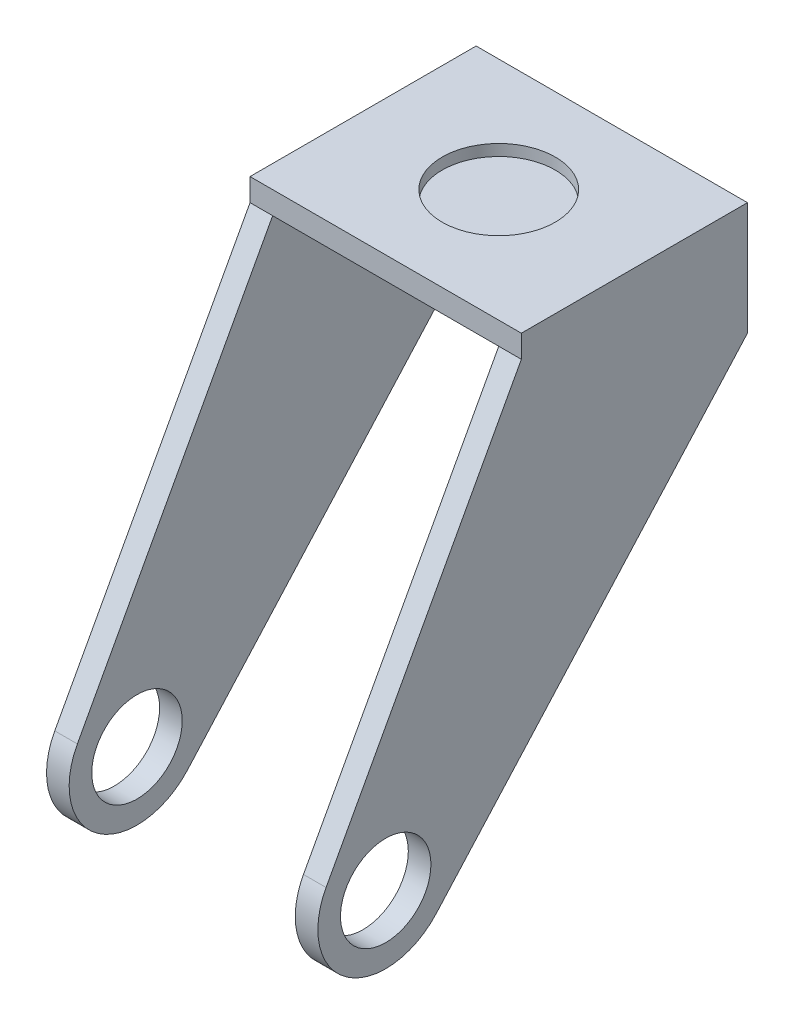
ISO-10303-21;
HEADER;
FILE_DESCRIPTION(('STEP AP214'),'2;1');
FILE_NAME('part.step','',(''),(''),'','','');
FILE_SCHEMA(('AUTOMOTIVE_DESIGN { 1 0 10303 214 1 1 1 1 }'));
ENDSEC;
DATA;
#1=APPLICATION_CONTEXT('core data for automotive mechanical design processes');
#2=APPLICATION_PROTOCOL_DEFINITION('international standard','automotive_design',2000,#1);
#3=PRODUCT_CONTEXT('',#1,'mechanical');
#4=PRODUCT('Part','Part','',(#3));
#5=PRODUCT_RELATED_PRODUCT_CATEGORY('part','',(#4));
#6=PRODUCT_DEFINITION_FORMATION('','',#4);
#7=PRODUCT_DEFINITION_CONTEXT('part definition',#1,'design');
#8=PRODUCT_DEFINITION('design','',#6,#7);
#9=PRODUCT_DEFINITION_SHAPE('','',#8);
#10=(LENGTH_UNIT() NAMED_UNIT(*) SI_UNIT(.MILLI.,.METRE.));
#11=(NAMED_UNIT(*) PLANE_ANGLE_UNIT() SI_UNIT($,.RADIAN.));
#12=(NAMED_UNIT(*) SI_UNIT($,.STERADIAN.) SOLID_ANGLE_UNIT());
#13=UNCERTAINTY_MEASURE_WITH_UNIT(LENGTH_MEASURE(1.E-05),#10,'distance_accuracy_value','');
#14=(GEOMETRIC_REPRESENTATION_CONTEXT(3) GLOBAL_UNCERTAINTY_ASSIGNED_CONTEXT((#13)) GLOBAL_UNIT_ASSIGNED_CONTEXT((#10,
#11,#12)) REPRESENTATION_CONTEXT('',''));
#15=CARTESIAN_POINT('',(0.,0.,0.));
#16=DIRECTION('',(0.,0.,1.));
#17=DIRECTION('',(1.,0.,0.));
#18=AXIS2_PLACEMENT_3D('',#15,#16,#17);
#19=CARTESIAN_POINT('',(5.,-86.722822296021,29.9981498854089));
#20=DIRECTION('',(1.,0.,0.));
#21=DIRECTION('',(0.,0.,-1.));
#22=AXIS2_PLACEMENT_3D('',#19,#20,#21);
#23=PLANE('',#22);
#24=DIRECTION('',(0.,-0.878900379190603,0.477005370471459));
#25=VECTOR('',#24,1.);
#26=CARTESIAN_POINT('',(5.,0.,0.));
#27=LINE('',#26,#25);
#28=CARTESIAN_POINT('',(5.,0.,0.));
#29=VERTEX_POINT('',#28);
#30=CARTESIAN_POINT('',(5.,-79.5668513281253,43.1832961887812));
#31=VERTEX_POINT('',#30);
#32=EDGE_CURVE('E230',#29,#31,#27,.T.);
#33=ORIENTED_EDGE('',*,*,#32,.T.);
#34=CARTESIAN_POINT('',(5.,-86.722822296021,29.9981498854089));
#35=DIRECTION('',(1.,0.,0.));
#36=DIRECTION('',(0.,0.,-1.));
#37=AXIS2_PLACEMENT_3D('',#34,#35,#36);
#38=CIRCLE('',#37,15.0018666683416);
#39=CARTESIAN_POINT('',(5.,-96.7356478948339,18.8267879692208));
#40=VERTEX_POINT('',#39);
#41=EDGE_CURVE('E83',#31,#40,#38,.T.);
#42=ORIENTED_EDGE('',*,*,#41,.T.);
#43=DIRECTION('',(0.,0.744428093663503,-0.667702638428607));
#44=VECTOR('',#43,1.);
#45=CARTESIAN_POINT('',(5.,-96.7356478948339,18.8267879692208));
#46=LINE('',#45,#44);
#47=CARTESIAN_POINT('',(5.,-20.,-50.));
#48=VERTEX_POINT('',#47);
#49=EDGE_CURVE('E236',#40,#48,#46,.T.);
#50=ORIENTED_EDGE('',*,*,#49,.T.);
#51=DIRECTION('',(0.,1.,0.));
#52=VECTOR('',#51,1.);
#53=CARTESIAN_POINT('',(5.,0.,-50.));
#54=LINE('',#53,#52);
#55=CARTESIAN_POINT('',(5.,0.,-50.));
#56=VERTEX_POINT('',#55);
#57=EDGE_CURVE('E239',#48,#56,#54,.T.);
#58=ORIENTED_EDGE('',*,*,#57,.T.);
#59=DIRECTION('',(0.,0.,1.));
#60=VECTOR('',#59,1.);
#61=CARTESIAN_POINT('',(5.,0.,0.));
#62=LINE('',#61,#60);
#63=EDGE_CURVE('E243',#56,#29,#62,.T.);
#64=ORIENTED_EDGE('',*,*,#63,.T.);
#65=EDGE_LOOP('',(#33,#42,#50,#58,#64));
#66=FACE_BOUND('',#65,.T.);
#67=CARTESIAN_POINT('',(5.,-86.722822296021,29.9981498854089));
#68=DIRECTION('',(1.,0.,0.));
#69=DIRECTION('',(0.,0.,-1.));
#70=AXIS2_PLACEMENT_3D('',#67,#68,#69);
#71=CIRCLE('',#70,10.);
#72=CARTESIAN_POINT('',(5.,-86.722822296021,19.9981498854089));
#73=VERTEX_POINT('',#72);
#74=EDGE_CURVE('E222',#73,#73,#71,.T.);
#75=ORIENTED_EDGE('',*,*,#74,.F.);
#76=EDGE_LOOP('',(#75));
#77=FACE_BOUND('',#76,.T.);
#78=ADVANCED_FACE('F39',(#66,#77),#23,.T.);
#79=CARTESIAN_POINT('',(0.,-86.722822296021,29.9981498854089));
#80=DIRECTION('',(1.,0.,0.));
#81=DIRECTION('',(0.,0.,-1.));
#82=AXIS2_PLACEMENT_3D('',#79,#80,#81);
#83=PLANE('',#82);
#84=DIRECTION('',(0.,-0.878900379190603,0.477005370471459));
#85=VECTOR('',#84,1.);
#86=CARTESIAN_POINT('',(0.,0.,0.));
#87=LINE('',#86,#85);
#88=CARTESIAN_POINT('',(0.,0.,0.));
#89=VERTEX_POINT('',#88);
#90=CARTESIAN_POINT('',(0.,-79.5668513281253,43.1832961887812));
#91=VERTEX_POINT('',#90);
#92=EDGE_CURVE('E226',#89,#91,#87,.T.);
#93=ORIENTED_EDGE('',*,*,#92,.F.);
#94=DIRECTION('',(0.,-1.,0.));
#95=VECTOR('',#94,1.);
#96=CARTESIAN_POINT('',(0.,5.,0.));
#97=LINE('',#96,#95);
#98=CARTESIAN_POINT('',(0.,5.,0.));
#99=VERTEX_POINT('',#98);
#100=EDGE_CURVE('E207',#99,#89,#97,.T.);
#101=ORIENTED_EDGE('',*,*,#100,.F.);
#102=DIRECTION('',(0.,0.,1.));
#103=VECTOR('',#102,1.);
#104=CARTESIAN_POINT('',(0.,5.,0.));
#105=LINE('',#104,#103);
#106=CARTESIAN_POINT('',(0.,5.,-50.));
#107=VERTEX_POINT('',#106);
#108=EDGE_CURVE('E204',#107,#99,#105,.T.);
#109=ORIENTED_EDGE('',*,*,#108,.F.);
#110=DIRECTION('',(0.,1.,0.));
#111=VECTOR('',#110,1.);
#112=CARTESIAN_POINT('',(0.,0.,-50.));
#113=LINE('',#112,#111);
#114=CARTESIAN_POINT('',(0.,-20.,-50.));
#115=VERTEX_POINT('',#114);
#116=EDGE_CURVE('E233',#115,#107,#113,.T.);
#117=ORIENTED_EDGE('',*,*,#116,.F.);
#118=DIRECTION('',(0.,0.744428093663503,-0.667702638428607));
#119=VECTOR('',#118,1.);
#120=CARTESIAN_POINT('',(0.,-96.7356478948339,18.8267879692208));
#121=LINE('',#120,#119);
#122=CARTESIAN_POINT('',(0.,-96.7356478948339,18.8267879692208));
#123=VERTEX_POINT('',#122);
#124=EDGE_CURVE('E78',#123,#115,#121,.T.);
#125=ORIENTED_EDGE('',*,*,#124,.F.);
#126=CARTESIAN_POINT('',(0.,-86.722822296021,29.9981498854089));
#127=DIRECTION('',(1.,0.,0.));
#128=DIRECTION('',(0.,0.,-1.));
#129=AXIS2_PLACEMENT_3D('',#126,#127,#128);
#130=CIRCLE('',#129,15.0018666683416);
#131=EDGE_CURVE('E71',#91,#123,#130,.T.);
#132=ORIENTED_EDGE('',*,*,#131,.F.);
#133=EDGE_LOOP('',(#93,#101,#109,#117,#125,#132));
#134=FACE_BOUND('',#133,.T.);
#135=CARTESIAN_POINT('',(0.,-86.722822296021,29.9981498854089));
#136=DIRECTION('',(1.,0.,0.));
#137=DIRECTION('',(0.,0.,-1.));
#138=AXIS2_PLACEMENT_3D('',#135,#136,#137);
#139=CIRCLE('',#138,10.);
#140=CARTESIAN_POINT('',(0.,-86.722822296021,19.9981498854089));
#141=VERTEX_POINT('',#140);
#142=EDGE_CURVE('E221',#141,#141,#139,.T.);
#143=ORIENTED_EDGE('',*,*,#142,.T.);
#144=EDGE_LOOP('',(#143));
#145=FACE_BOUND('',#144,.T.);
#146=ADVANCED_FACE('F266',(#134,#145),#83,.F.);
#147=CARTESIAN_POINT('',(5.,0.,0.));
#148=DIRECTION('',(0.,-0.477005370471459,-0.878900379190603));
#149=DIRECTION('',(0.,0.878900379190603,-0.477005370471459));
#150=AXIS2_PLACEMENT_3D('',#147,#148,#149);
#151=PLANE('',#150);
#152=ORIENTED_EDGE('',*,*,#92,.T.);
#153=DIRECTION('',(-1.,0.,0.));
#154=VECTOR('',#153,1.);
#155=CARTESIAN_POINT('',(5.,-79.5668513281253,43.1832961887812));
#156=LINE('',#155,#154);
#157=EDGE_CURVE('E11',#31,#91,#156,.T.);
#158=ORIENTED_EDGE('',*,*,#157,.F.);
#159=ORIENTED_EDGE('',*,*,#32,.F.);
#160=DIRECTION('',(-1.,0.,0.));
#161=VECTOR('',#160,1.);
#162=CARTESIAN_POINT('',(5.,0.,0.));
#163=LINE('',#162,#161);
#164=EDGE_CURVE('E57',#29,#89,#163,.T.);
#165=ORIENTED_EDGE('',*,*,#164,.T.);
#166=EDGE_LOOP('',(#152,#158,#159,#165));
#167=FACE_BOUND('',#166,.T.);
#168=ADVANCED_FACE('F41',(#167),#151,.F.);
#169=CARTESIAN_POINT('',(5.,-86.722822296021,29.9981498854089));
#170=DIRECTION('',(-1.,0.,0.));
#171=DIRECTION('',(0.,0.,1.));
#172=AXIS2_PLACEMENT_3D('',#169,#170,#171);
#173=CYLINDRICAL_SURFACE('',#172,15.0018666683416);
#174=ORIENTED_EDGE('',*,*,#131,.T.);
#175=DIRECTION('',(-1.,0.,0.));
#176=VECTOR('',#175,1.);
#177=CARTESIAN_POINT('',(5.,-96.7356478948339,18.8267879692208));
#178=LINE('',#177,#176);
#179=EDGE_CURVE('E49',#40,#123,#178,.T.);
#180=ORIENTED_EDGE('',*,*,#179,.F.);
#181=ORIENTED_EDGE('',*,*,#41,.F.);
#182=ORIENTED_EDGE('',*,*,#157,.T.);
#183=EDGE_LOOP('',(#174,#180,#181,#182));
#184=FACE_BOUND('',#183,.T.);
#185=ADVANCED_FACE('F294',(#184),#173,.T.);
#186=CARTESIAN_POINT('',(5.,-96.7356478948339,18.8267879692208));
#187=DIRECTION('',(0.,0.667702638428607,0.744428093663503));
#188=DIRECTION('',(0.,-0.744428093663503,0.667702638428607));
#189=AXIS2_PLACEMENT_3D('',#186,#187,#188);
#190=PLANE('',#189);
#191=ORIENTED_EDGE('',*,*,#124,.T.);
#192=DIRECTION('',(-1.,0.,0.));
#193=VECTOR('',#192,1.);
#194=CARTESIAN_POINT('',(5.,-20.,-50.));
#195=LINE('',#194,#193);
#196=EDGE_CURVE('E258',#48,#115,#195,.T.);
#197=ORIENTED_EDGE('',*,*,#196,.F.);
#198=ORIENTED_EDGE('',*,*,#49,.F.);
#199=ORIENTED_EDGE('',*,*,#179,.T.);
#200=EDGE_LOOP('',(#191,#197,#198,#199));
#201=FACE_BOUND('',#200,.T.);
#202=ADVANCED_FACE('F262',(#201),#190,.F.);
#203=CARTESIAN_POINT('',(5.,0.,-50.));
#204=DIRECTION('',(0.,0.,1.));
#205=DIRECTION('',(1.,0.,0.));
#206=AXIS2_PLACEMENT_3D('',#203,#204,#205);
#207=PLANE('',#206);
#208=ORIENTED_EDGE('',*,*,#116,.T.);
#209=DIRECTION('',(-1.,0.,0.));
#210=VECTOR('',#209,1.);
#211=CARTESIAN_POINT('',(0.,5.,-50.));
#212=LINE('',#211,#210);
#213=CARTESIAN_POINT('',(60.,5.,-50.));
#214=VERTEX_POINT('',#213);
#215=EDGE_CURVE('E200',#214,#107,#212,.T.);
#216=ORIENTED_EDGE('',*,*,#215,.F.);
#217=DIRECTION('',(0.,-1.,0.));
#218=VECTOR('',#217,1.);
#219=CARTESIAN_POINT('',(60.,5.,-50.));
#220=LINE('',#219,#218);
#221=CARTESIAN_POINT('',(60.,-20.,-50.));
#222=VERTEX_POINT('',#221);
#223=EDGE_CURVE('E214',#214,#222,#220,.T.);
#224=ORIENTED_EDGE('',*,*,#223,.T.);
#225=DIRECTION('',(1.,0.,0.));
#226=VECTOR('',#225,1.);
#227=CARTESIAN_POINT('',(55.,-20.,-50.));
#228=LINE('',#227,#226);
#229=CARTESIAN_POINT('',(55.,-20.,-50.));
#230=VERTEX_POINT('',#229);
#231=EDGE_CURVE('E186',#230,#222,#228,.T.);
#232=ORIENTED_EDGE('',*,*,#231,.F.);
#233=DIRECTION('',(0.,1.,0.));
#234=VECTOR('',#233,1.);
#235=CARTESIAN_POINT('',(55.,0.,-50.));
#236=LINE('',#235,#234);
#237=CARTESIAN_POINT('',(55.,0.,-50.));
#238=VERTEX_POINT('',#237);
#239=EDGE_CURVE('E172',#230,#238,#236,.T.);
#240=ORIENTED_EDGE('',*,*,#239,.T.);
#241=DIRECTION('',(-1.,0.,0.));
#242=VECTOR('',#241,1.);
#243=CARTESIAN_POINT('',(0.,0.,-50.));
#244=LINE('',#243,#242);
#245=EDGE_CURVE('E197',#238,#56,#244,.T.);
#246=ORIENTED_EDGE('',*,*,#245,.T.);
#247=ORIENTED_EDGE('',*,*,#57,.F.);
#248=ORIENTED_EDGE('',*,*,#196,.T.);
#249=EDGE_LOOP('',(#208,#216,#224,#232,#240,#246,#247,#248));
#250=FACE_BOUND('',#249,.T.);
#251=ADVANCED_FACE('F272',(#250),#207,.F.);
#252=CARTESIAN_POINT('',(5.,-86.722822296021,29.9981498854089));
#253=DIRECTION('',(-1.,0.,0.));
#254=DIRECTION('',(0.,0.,1.));
#255=AXIS2_PLACEMENT_3D('',#252,#253,#254);
#256=CYLINDRICAL_SURFACE('',#255,10.);
#257=ORIENTED_EDGE('',*,*,#74,.T.);
#258=EDGE_LOOP('',(#257));
#259=FACE_BOUND('',#258,.T.);
#260=ORIENTED_EDGE('',*,*,#142,.F.);
#261=EDGE_LOOP('',(#260));
#262=FACE_BOUND('',#261,.T.);
#263=ADVANCED_FACE('F308',(#259,#262),#256,.F.);
#264=CARTESIAN_POINT('',(0.,0.,0.));
#265=DIRECTION('',(0.,-1.,0.));
#266=DIRECTION('',(0.,0.,-1.));
#267=AXIS2_PLACEMENT_3D('',#264,#265,#266);
#268=PLANE('',#267);
#269=DIRECTION('',(0.,0.,1.));
#270=VECTOR('',#269,1.);
#271=CARTESIAN_POINT('',(55.,0.,0.));
#272=LINE('',#271,#270);
#273=CARTESIAN_POINT('',(55.,0.,0.));
#274=VERTEX_POINT('',#273);
#275=EDGE_CURVE('E175',#238,#274,#272,.T.);
#276=ORIENTED_EDGE('',*,*,#275,.T.);
#277=DIRECTION('',(1.,0.,0.));
#278=VECTOR('',#277,1.);
#279=CARTESIAN_POINT('',(60.,0.,0.));
#280=LINE('',#279,#278);
#281=EDGE_CURVE('E142',#29,#274,#280,.T.);
#282=ORIENTED_EDGE('',*,*,#281,.F.);
#283=ORIENTED_EDGE('',*,*,#63,.F.);
#284=ORIENTED_EDGE('',*,*,#245,.F.);
#285=EDGE_LOOP('',(#276,#282,#283,#284));
#286=FACE_BOUND('',#285,.T.);
#287=ADVANCED_FACE('F288',(#286),#268,.T.);
#288=CARTESIAN_POINT('',(60.,5.,0.));
#289=DIRECTION('',(0.,0.,-1.));
#290=DIRECTION('',(-1.,0.,0.));
#291=AXIS2_PLACEMENT_3D('',#288,#289,#290);
#292=PLANE('',#291);
#293=ORIENTED_EDGE('',*,*,#164,.F.);
#294=ORIENTED_EDGE('',*,*,#281,.T.);
#295=DIRECTION('',(1.,0.,0.));
#296=VECTOR('',#295,1.);
#297=CARTESIAN_POINT('',(55.,0.,0.));
#298=LINE('',#297,#296);
#299=CARTESIAN_POINT('',(60.,0.,0.));
#300=VERTEX_POINT('',#299);
#301=EDGE_CURVE('E159',#274,#300,#298,.T.);
#302=ORIENTED_EDGE('',*,*,#301,.T.);
#303=DIRECTION('',(0.,-1.,0.));
#304=VECTOR('',#303,1.);
#305=CARTESIAN_POINT('',(60.,5.,0.));
#306=LINE('',#305,#304);
#307=CARTESIAN_POINT('',(60.,5.,0.));
#308=VERTEX_POINT('',#307);
#309=EDGE_CURVE('E217',#308,#300,#306,.T.);
#310=ORIENTED_EDGE('',*,*,#309,.F.);
#311=DIRECTION('',(1.,0.,0.));
#312=VECTOR('',#311,1.);
#313=CARTESIAN_POINT('',(60.,5.,0.));
#314=LINE('',#313,#312);
#315=EDGE_CURVE('E192',#99,#308,#314,.T.);
#316=ORIENTED_EDGE('',*,*,#315,.F.);
#317=ORIENTED_EDGE('',*,*,#100,.T.);
#318=EDGE_LOOP('',(#293,#294,#302,#310,#316,#317));
#319=FACE_BOUND('',#318,.T.);
#320=ADVANCED_FACE('F319',(#319),#292,.F.);
#321=CARTESIAN_POINT('',(60.,5.,-50.));
#322=DIRECTION('',(-1.,0.,0.));
#323=DIRECTION('',(0.,0.,1.));
#324=AXIS2_PLACEMENT_3D('',#321,#322,#323);
#325=PLANE('',#324);
#326=ORIENTED_EDGE('',*,*,#309,.T.);
#327=DIRECTION('',(0.,-0.878900379190603,0.477005370471459));
#328=VECTOR('',#327,1.);
#329=CARTESIAN_POINT('',(60.,0.,0.));
#330=LINE('',#329,#328);
#331=CARTESIAN_POINT('',(60.,-79.5668513281253,43.1832961887812));
#332=VERTEX_POINT('',#331);
#333=EDGE_CURVE('E178',#300,#332,#330,.T.);
#334=ORIENTED_EDGE('',*,*,#333,.T.);
#335=CARTESIAN_POINT('',(60.,-86.722822296021,29.9981498854089));
#336=DIRECTION('',(1.,0.,0.));
#337=DIRECTION('',(0.,0.,-1.));
#338=AXIS2_PLACEMENT_3D('',#335,#336,#337);
#339=CIRCLE('',#338,15.0018666683416);
#340=CARTESIAN_POINT('',(60.,-96.7356478948339,18.8267879692208));
#341=VERTEX_POINT('',#340);
#342=EDGE_CURVE('E137',#332,#341,#339,.T.);
#343=ORIENTED_EDGE('',*,*,#342,.T.);
#344=DIRECTION('',(0.,0.744428093663503,-0.667702638428607));
#345=VECTOR('',#344,1.);
#346=CARTESIAN_POINT('',(60.,-96.7356478948339,18.8267879692208));
#347=LINE('',#346,#345);
#348=EDGE_CURVE('E161',#341,#222,#347,.T.);
#349=ORIENTED_EDGE('',*,*,#348,.T.);
#350=ORIENTED_EDGE('',*,*,#223,.F.);
#351=DIRECTION('',(0.,0.,-1.));
#352=VECTOR('',#351,1.);
#353=CARTESIAN_POINT('',(60.,5.,-50.));
#354=LINE('',#353,#352);
#355=EDGE_CURVE('E196',#308,#214,#354,.T.);
#356=ORIENTED_EDGE('',*,*,#355,.F.);
#357=EDGE_LOOP('',(#326,#334,#343,#349,#350,#356));
#358=FACE_BOUND('',#357,.T.);
#359=CARTESIAN_POINT('',(60.,-86.722822296021,29.9981498854089));
#360=DIRECTION('',(1.,0.,0.));
#361=DIRECTION('',(0.,0.,-1.));
#362=AXIS2_PLACEMENT_3D('',#359,#360,#361);
#363=CIRCLE('',#362,10.);
#364=CARTESIAN_POINT('',(60.,-86.722822296021,19.9981498854089));
#365=VERTEX_POINT('',#364);
#366=EDGE_CURVE('E167',#365,#365,#363,.T.);
#367=ORIENTED_EDGE('',*,*,#366,.F.);
#368=EDGE_LOOP('',(#367));
#369=FACE_BOUND('',#368,.T.);
#370=ADVANCED_FACE('F280',(#358,#369),#325,.F.);
#371=CARTESIAN_POINT('',(0.,5.,0.));
#372=DIRECTION('',(0.,-1.,0.));
#373=DIRECTION('',(0.,0.,-1.));
#374=AXIS2_PLACEMENT_3D('',#371,#372,#373);
#375=PLANE('',#374);
#376=CARTESIAN_POINT('',(30.,5.,-25.));
#377=DIRECTION('',(0.,1.,0.));
#378=DIRECTION('',(0.,0.,1.));
#379=AXIS2_PLACEMENT_3D('',#376,#377,#378);
#380=CIRCLE('',#379,12.5);
#381=CARTESIAN_POINT('',(30.,5.,-12.5));
#382=VERTEX_POINT('',#381);
#383=EDGE_CURVE('E341',#382,#382,#380,.T.);
#384=ORIENTED_EDGE('',*,*,#383,.F.);
#385=EDGE_LOOP('',(#384));
#386=FACE_BOUND('',#385,.T.);
#387=ORIENTED_EDGE('',*,*,#315,.T.);
#388=ORIENTED_EDGE('',*,*,#355,.T.);
#389=ORIENTED_EDGE('',*,*,#215,.T.);
#390=ORIENTED_EDGE('',*,*,#108,.T.);
#391=EDGE_LOOP('',(#387,#388,#389,#390));
#392=FACE_BOUND('',#391,.T.);
#393=ADVANCED_FACE('F275',(#386,#392),#375,.F.);
#394=CARTESIAN_POINT('',(55.,-86.722822296021,29.9981498854089));
#395=DIRECTION('',(-1.,0.,0.));
#396=DIRECTION('',(0.,0.,-1.));
#397=AXIS2_PLACEMENT_3D('',#394,#395,#396);
#398=PLANE('',#397);
#399=DIRECTION('',(0.,-0.878900379190603,0.477005370471459));
#400=VECTOR('',#399,1.);
#401=CARTESIAN_POINT('',(55.,0.,0.));
#402=LINE('',#401,#400);
#403=CARTESIAN_POINT('',(55.,-79.5668513281253,43.1832961887812));
#404=VERTEX_POINT('',#403);
#405=EDGE_CURVE('E150',#274,#404,#402,.T.);
#406=ORIENTED_EDGE('',*,*,#405,.F.);
#407=ORIENTED_EDGE('',*,*,#275,.F.);
#408=ORIENTED_EDGE('',*,*,#239,.F.);
#409=DIRECTION('',(0.,0.744428093663503,-0.667702638428607));
#410=VECTOR('',#409,1.);
#411=CARTESIAN_POINT('',(55.,-96.7356478948339,18.8267879692208));
#412=LINE('',#411,#410);
#413=CARTESIAN_POINT('',(55.,-96.7356478948339,18.8267879692208));
#414=VERTEX_POINT('',#413);
#415=EDGE_CURVE('E154',#414,#230,#412,.T.);
#416=ORIENTED_EDGE('',*,*,#415,.F.);
#417=CARTESIAN_POINT('',(55.,-86.722822296021,29.9981498854089));
#418=DIRECTION('',(1.,0.,0.));
#419=DIRECTION('',(0.,0.,-1.));
#420=AXIS2_PLACEMENT_3D('',#417,#418,#419);
#421=CIRCLE('',#420,15.0018666683416);
#422=EDGE_CURVE('E134',#404,#414,#421,.T.);
#423=ORIENTED_EDGE('',*,*,#422,.F.);
#424=EDGE_LOOP('',(#406,#407,#408,#416,#423));
#425=FACE_BOUND('',#424,.T.);
#426=CARTESIAN_POINT('',(55.,-86.722822296021,29.9981498854089));
#427=DIRECTION('',(1.,0.,0.));
#428=DIRECTION('',(0.,0.,-1.));
#429=AXIS2_PLACEMENT_3D('',#426,#427,#428);
#430=CIRCLE('',#429,10.);
#431=CARTESIAN_POINT('',(55.,-86.722822296021,19.9981498854089));
#432=VERTEX_POINT('',#431);
#433=EDGE_CURVE('E181',#432,#432,#430,.T.);
#434=ORIENTED_EDGE('',*,*,#433,.T.);
#435=EDGE_LOOP('',(#434));
#436=FACE_BOUND('',#435,.T.);
#437=ADVANCED_FACE('F147',(#425,#436),#398,.T.);
#438=CARTESIAN_POINT('',(55.,0.,0.));
#439=DIRECTION('',(0.,-0.477005370471459,-0.878900379190603));
#440=DIRECTION('',(0.,0.878900379190603,-0.477005370471459));
#441=AXIS2_PLACEMENT_3D('',#438,#439,#440);
#442=PLANE('',#441);
#443=ORIENTED_EDGE('',*,*,#333,.F.);
#444=ORIENTED_EDGE('',*,*,#301,.F.);
#445=ORIENTED_EDGE('',*,*,#405,.T.);
#446=DIRECTION('',(1.,0.,0.));
#447=VECTOR('',#446,1.);
#448=CARTESIAN_POINT('',(55.,-79.5668513281253,43.1832961887812));
#449=LINE('',#448,#447);
#450=EDGE_CURVE('E131',#404,#332,#449,.T.);
#451=ORIENTED_EDGE('',*,*,#450,.T.);
#452=EDGE_LOOP('',(#443,#444,#445,#451));
#453=FACE_BOUND('',#452,.T.);
#454=ADVANCED_FACE('F157',(#453),#442,.F.);
#455=CARTESIAN_POINT('',(55.,-86.722822296021,29.9981498854089));
#456=DIRECTION('',(1.,0.,0.));
#457=DIRECTION('',(0.,0.,1.));
#458=AXIS2_PLACEMENT_3D('',#455,#456,#457);
#459=CYLINDRICAL_SURFACE('',#458,15.0018666683416);
#460=ORIENTED_EDGE('',*,*,#342,.F.);
#461=ORIENTED_EDGE('',*,*,#450,.F.);
#462=ORIENTED_EDGE('',*,*,#422,.T.);
#463=DIRECTION('',(1.,0.,0.));
#464=VECTOR('',#463,1.);
#465=CARTESIAN_POINT('',(55.,-96.7356478948339,18.8267879692208));
#466=LINE('',#465,#464);
#467=EDGE_CURVE('E143',#414,#341,#466,.T.);
#468=ORIENTED_EDGE('',*,*,#467,.T.);
#469=EDGE_LOOP('',(#460,#461,#462,#468));
#470=FACE_BOUND('',#469,.T.);
#471=ADVANCED_FACE('F133',(#470),#459,.T.);
#472=CARTESIAN_POINT('',(55.,-96.7356478948339,18.8267879692208));
#473=DIRECTION('',(0.,0.667702638428607,0.744428093663503));
#474=DIRECTION('',(0.,-0.744428093663503,0.667702638428607));
#475=AXIS2_PLACEMENT_3D('',#472,#473,#474);
#476=PLANE('',#475);
#477=ORIENTED_EDGE('',*,*,#348,.F.);
#478=ORIENTED_EDGE('',*,*,#467,.F.);
#479=ORIENTED_EDGE('',*,*,#415,.T.);
#480=ORIENTED_EDGE('',*,*,#231,.T.);
#481=EDGE_LOOP('',(#477,#478,#479,#480));
#482=FACE_BOUND('',#481,.T.);
#483=ADVANCED_FACE('F284',(#482),#476,.F.);
#484=CARTESIAN_POINT('',(55.,-86.722822296021,29.9981498854089));
#485=DIRECTION('',(1.,0.,0.));
#486=DIRECTION('',(0.,0.,1.));
#487=AXIS2_PLACEMENT_3D('',#484,#485,#486);
#488=CYLINDRICAL_SURFACE('',#487,10.);
#489=ORIENTED_EDGE('',*,*,#433,.F.);
#490=EDGE_LOOP('',(#489));
#491=FACE_BOUND('',#490,.T.);
#492=ORIENTED_EDGE('',*,*,#366,.T.);
#493=EDGE_LOOP('',(#492));
#494=FACE_BOUND('',#493,.T.);
#495=ADVANCED_FACE('F356',(#491,#494),#488,.F.);
#496=CARTESIAN_POINT('',(30.,2.5,-25.));
#497=DIRECTION('',(0.,1.,0.));
#498=DIRECTION('',(0.,0.,1.));
#499=AXIS2_PLACEMENT_3D('',#496,#497,#498);
#500=CYLINDRICAL_SURFACE('',#499,12.5);
#501=CARTESIAN_POINT('',(30.,2.5,-25.));
#502=DIRECTION('',(0.,1.,0.));
#503=DIRECTION('',(0.,0.,1.));
#504=AXIS2_PLACEMENT_3D('',#501,#502,#503);
#505=CIRCLE('',#504,12.5);
#506=CARTESIAN_POINT('',(30.,2.5,-12.5));
#507=VERTEX_POINT('',#506);
#508=EDGE_CURVE('E344',#507,#507,#505,.T.);
#509=ORIENTED_EDGE('',*,*,#508,.F.);
#510=EDGE_LOOP('',(#509));
#511=FACE_BOUND('',#510,.T.);
#512=ORIENTED_EDGE('',*,*,#383,.T.);
#513=EDGE_LOOP('',(#512));
#514=FACE_BOUND('',#513,.T.);
#515=ADVANCED_FACE('F358',(#511,#514),#500,.F.);
#516=CARTESIAN_POINT('',(30.,2.5,-25.));
#517=DIRECTION('',(0.,1.,0.));
#518=DIRECTION('',(0.,0.,1.));
#519=AXIS2_PLACEMENT_3D('',#516,#517,#518);
#520=PLANE('',#519);
#521=ORIENTED_EDGE('',*,*,#508,.T.);
#522=EDGE_LOOP('',(#521));
#523=FACE_BOUND('',#522,.T.);
#524=ADVANCED_FACE('F365',(#523),#520,.T.);
#525=CLOSED_SHELL('',(#78,#146,#168,#185,#202,#251,#263,#287,#320,#370,#393,#437,#454,#471,#483,
#495,#515,#524));
#526=MANIFOLD_SOLID_BREP('B2',#525);
#527=ADVANCED_BREP_SHAPE_REPRESENTATION('',(#18,#526),#14);
#528=SHAPE_DEFINITION_REPRESENTATION(#9,#527);
ENDSEC;
END-ISO-10303-21;
